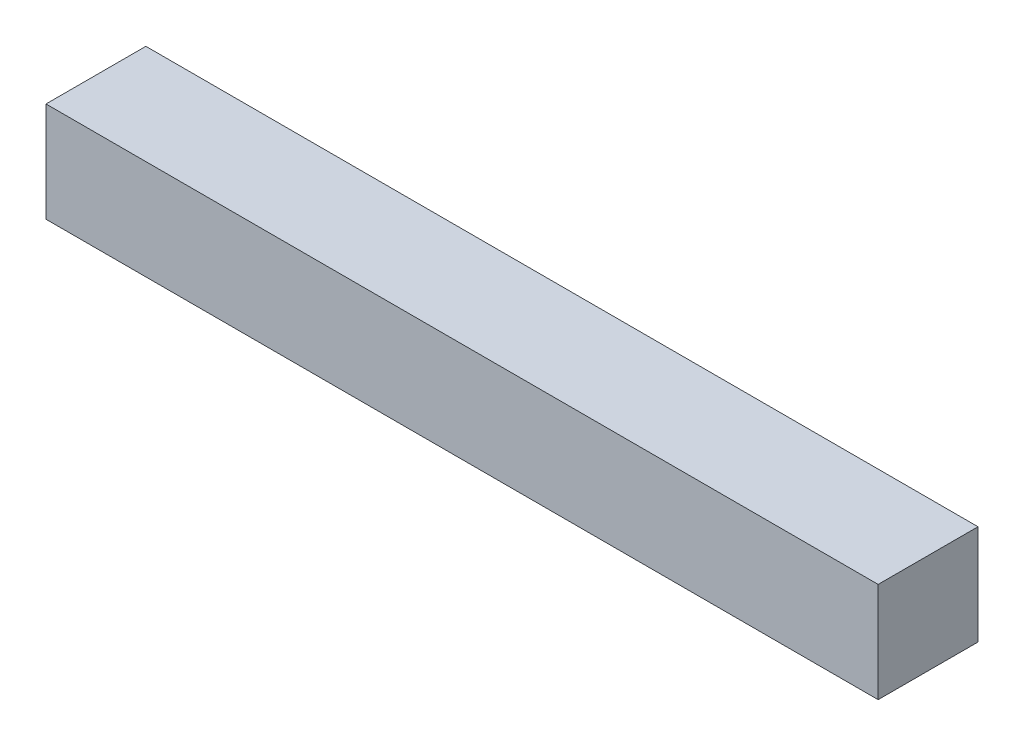
ISO-10303-21;
HEADER;
FILE_DESCRIPTION(('STEP AP214'),'2;1');
FILE_NAME('part.step','',(''),(''),'','','');
FILE_SCHEMA(('AUTOMOTIVE_DESIGN { 1 0 10303 214 1 1 1 1 }'));
ENDSEC;
DATA;
#1=APPLICATION_CONTEXT('core data for automotive mechanical design processes');
#2=APPLICATION_PROTOCOL_DEFINITION('international standard','automotive_design',2000,#1);
#3=PRODUCT_CONTEXT('',#1,'mechanical');
#4=PRODUCT('Part','Part','',(#3));
#5=PRODUCT_RELATED_PRODUCT_CATEGORY('part','',(#4));
#6=PRODUCT_DEFINITION_FORMATION('','',#4);
#7=PRODUCT_DEFINITION_CONTEXT('part definition',#1,'design');
#8=PRODUCT_DEFINITION('design','',#6,#7);
#9=PRODUCT_DEFINITION_SHAPE('','',#8);
#10=(LENGTH_UNIT() NAMED_UNIT(*) SI_UNIT(.MILLI.,.METRE.));
#11=(NAMED_UNIT(*) PLANE_ANGLE_UNIT() SI_UNIT($,.RADIAN.));
#12=(NAMED_UNIT(*) SI_UNIT($,.STERADIAN.) SOLID_ANGLE_UNIT());
#13=UNCERTAINTY_MEASURE_WITH_UNIT(LENGTH_MEASURE(1.E-05),#10,'distance_accuracy_value','');
#14=(GEOMETRIC_REPRESENTATION_CONTEXT(3) GLOBAL_UNCERTAINTY_ASSIGNED_CONTEXT((#13)) GLOBAL_UNIT_ASSIGNED_CONTEXT((#10,
#11,#12)) REPRESENTATION_CONTEXT('',''));
#15=CARTESIAN_POINT('',(0.,0.,0.));
#16=DIRECTION('',(0.,0.,1.));
#17=DIRECTION('',(1.,0.,0.));
#18=AXIS2_PLACEMENT_3D('',#15,#16,#17);
#19=CARTESIAN_POINT('',(250.,30.,60.));
#20=DIRECTION('',(-1.,0.,0.));
#21=DIRECTION('',(0.,0.,1.));
#22=AXIS2_PLACEMENT_3D('',#19,#20,#21);
#23=PLANE('',#22);
#24=DIRECTION('',(0.,1.,0.));
#25=VECTOR('',#24,1.);
#26=CARTESIAN_POINT('',(250.,30.,0.));
#27=LINE('',#26,#25);
#28=CARTESIAN_POINT('',(250.,-30.,0.));
#29=VERTEX_POINT('',#28);
#30=CARTESIAN_POINT('',(250.,30.,0.));
#31=VERTEX_POINT('',#30);
#32=EDGE_CURVE('E97',#29,#31,#27,.T.);
#33=ORIENTED_EDGE('',*,*,#32,.T.);
#34=DIRECTION('',(0.,0.,-1.));
#35=VECTOR('',#34,1.);
#36=CARTESIAN_POINT('',(250.,30.,60.));
#37=LINE('',#36,#35);
#38=CARTESIAN_POINT('',(250.,30.,60.));
#39=VERTEX_POINT('',#38);
#40=EDGE_CURVE('E11',#39,#31,#37,.T.);
#41=ORIENTED_EDGE('',*,*,#40,.F.);
#42=DIRECTION('',(0.,1.,0.));
#43=VECTOR('',#42,1.);
#44=CARTESIAN_POINT('',(250.,30.,60.));
#45=LINE('',#44,#43);
#46=CARTESIAN_POINT('',(250.,-30.,60.));
#47=VERTEX_POINT('',#46);
#48=EDGE_CURVE('E85',#47,#39,#45,.T.);
#49=ORIENTED_EDGE('',*,*,#48,.F.);
#50=DIRECTION('',(0.,0.,-1.));
#51=VECTOR('',#50,1.);
#52=CARTESIAN_POINT('',(250.,-30.,60.));
#53=LINE('',#52,#51);
#54=EDGE_CURVE('E93',#47,#29,#53,.T.);
#55=ORIENTED_EDGE('',*,*,#54,.T.);
#56=EDGE_LOOP('',(#33,#41,#49,#55));
#57=FACE_BOUND('',#56,.T.);
#58=ADVANCED_FACE('F33',(#57),#23,.F.);
#59=CARTESIAN_POINT('',(-250.,30.,60.));
#60=DIRECTION('',(0.,-1.,0.));
#61=DIRECTION('',(0.,0.,-1.));
#62=AXIS2_PLACEMENT_3D('',#59,#60,#61);
#63=PLANE('',#62);
#64=DIRECTION('',(-1.,0.,0.));
#65=VECTOR('',#64,1.);
#66=CARTESIAN_POINT('',(-250.,30.,0.));
#67=LINE('',#66,#65);
#68=CARTESIAN_POINT('',(-250.,30.,0.));
#69=VERTEX_POINT('',#68);
#70=EDGE_CURVE('E89',#31,#69,#67,.T.);
#71=ORIENTED_EDGE('',*,*,#70,.T.);
#72=DIRECTION('',(0.,0.,-1.));
#73=VECTOR('',#72,1.);
#74=CARTESIAN_POINT('',(-250.,30.,60.));
#75=LINE('',#74,#73);
#76=CARTESIAN_POINT('',(-250.,30.,60.));
#77=VERTEX_POINT('',#76);
#78=EDGE_CURVE('E42',#77,#69,#75,.T.);
#79=ORIENTED_EDGE('',*,*,#78,.F.);
#80=DIRECTION('',(-1.,0.,0.));
#81=VECTOR('',#80,1.);
#82=CARTESIAN_POINT('',(-250.,30.,60.));
#83=LINE('',#82,#81);
#84=EDGE_CURVE('E80',#39,#77,#83,.T.);
#85=ORIENTED_EDGE('',*,*,#84,.F.);
#86=ORIENTED_EDGE('',*,*,#40,.T.);
#87=EDGE_LOOP('',(#71,#79,#85,#86));
#88=FACE_BOUND('',#87,.T.);
#89=ADVANCED_FACE('F88',(#88),#63,.F.);
#90=CARTESIAN_POINT('',(-250.,30.,60.));
#91=DIRECTION('',(1.,0.,0.));
#92=DIRECTION('',(0.,0.,-1.));
#93=AXIS2_PLACEMENT_3D('',#90,#91,#92);
#94=PLANE('',#93);
#95=DIRECTION('',(0.,-1.,0.));
#96=VECTOR('',#95,1.);
#97=CARTESIAN_POINT('',(-250.,30.,0.));
#98=LINE('',#97,#96);
#99=CARTESIAN_POINT('',(-250.,-30.,0.));
#100=VERTEX_POINT('',#99);
#101=EDGE_CURVE('E67',#69,#100,#98,.T.);
#102=ORIENTED_EDGE('',*,*,#101,.T.);
#103=DIRECTION('',(0.,0.,-1.));
#104=VECTOR('',#103,1.);
#105=CARTESIAN_POINT('',(-250.,-30.,60.));
#106=LINE('',#105,#104);
#107=CARTESIAN_POINT('',(-250.,-30.,60.));
#108=VERTEX_POINT('',#107);
#109=EDGE_CURVE('E90',#108,#100,#106,.T.);
#110=ORIENTED_EDGE('',*,*,#109,.F.);
#111=DIRECTION('',(0.,-1.,0.));
#112=VECTOR('',#111,1.);
#113=CARTESIAN_POINT('',(-250.,30.,60.));
#114=LINE('',#113,#112);
#115=EDGE_CURVE('E83',#77,#108,#114,.T.);
#116=ORIENTED_EDGE('',*,*,#115,.F.);
#117=ORIENTED_EDGE('',*,*,#78,.T.);
#118=EDGE_LOOP('',(#102,#110,#116,#117));
#119=FACE_BOUND('',#118,.T.);
#120=ADVANCED_FACE('F91',(#119),#94,.F.);
#121=CARTESIAN_POINT('',(-250.,-30.,60.));
#122=DIRECTION('',(0.,1.,0.));
#123=DIRECTION('',(0.,0.,1.));
#124=AXIS2_PLACEMENT_3D('',#121,#122,#123);
#125=PLANE('',#124);
#126=DIRECTION('',(1.,0.,0.));
#127=VECTOR('',#126,1.);
#128=CARTESIAN_POINT('',(-250.,-30.,0.));
#129=LINE('',#128,#127);
#130=EDGE_CURVE('E73',#100,#29,#129,.T.);
#131=ORIENTED_EDGE('',*,*,#130,.T.);
#132=ORIENTED_EDGE('',*,*,#54,.F.);
#133=DIRECTION('',(1.,0.,0.));
#134=VECTOR('',#133,1.);
#135=CARTESIAN_POINT('',(-250.,-30.,60.));
#136=LINE('',#135,#134);
#137=EDGE_CURVE('E50',#108,#47,#136,.T.);
#138=ORIENTED_EDGE('',*,*,#137,.F.);
#139=ORIENTED_EDGE('',*,*,#109,.T.);
#140=EDGE_LOOP('',(#131,#132,#138,#139));
#141=FACE_BOUND('',#140,.T.);
#142=ADVANCED_FACE('F105',(#141),#125,.F.);
#143=CARTESIAN_POINT('',(0.,0.,60.));
#144=DIRECTION('',(0.,0.,1.));
#145=DIRECTION('',(1.,0.,0.));
#146=AXIS2_PLACEMENT_3D('',#143,#144,#145);
#147=PLANE('',#146);
#148=ORIENTED_EDGE('',*,*,#48,.T.);
#149=ORIENTED_EDGE('',*,*,#84,.T.);
#150=ORIENTED_EDGE('',*,*,#115,.T.);
#151=ORIENTED_EDGE('',*,*,#137,.T.);
#152=EDGE_LOOP('',(#148,#149,#150,#151));
#153=FACE_BOUND('',#152,.T.);
#154=ADVANCED_FACE('F81',(#153),#147,.T.);
#155=CARTESIAN_POINT('',(0.,0.,0.));
#156=DIRECTION('',(0.,0.,1.));
#157=DIRECTION('',(1.,0.,0.));
#158=AXIS2_PLACEMENT_3D('',#155,#156,#157);
#159=PLANE('',#158);
#160=CARTESIAN_POINT('',(-187.5,0.,0.));
#161=DIRECTION('',(0.,0.,-1.));
#162=DIRECTION('',(-1.,0.,0.));
#163=AXIS2_PLACEMENT_3D('',#160,#161,#162);
#164=CIRCLE('',#163,25.);
#165=CARTESIAN_POINT('',(-212.5,0.,0.));
#166=VERTEX_POINT('',#165);
#167=EDGE_CURVE('E128',#166,#166,#164,.T.);
#168=ORIENTED_EDGE('',*,*,#167,.F.);
#169=EDGE_LOOP('',(#168));
#170=FACE_BOUND('',#169,.T.);
#171=CARTESIAN_POINT('',(-125.,0.,0.));
#172=DIRECTION('',(0.,0.,-1.));
#173=DIRECTION('',(-1.,0.,0.));
#174=AXIS2_PLACEMENT_3D('',#171,#172,#173);
#175=CIRCLE('',#174,25.);
#176=CARTESIAN_POINT('',(-150.,0.,0.));
#177=VERTEX_POINT('',#176);
#178=EDGE_CURVE('E125',#177,#177,#175,.T.);
#179=ORIENTED_EDGE('',*,*,#178,.F.);
#180=EDGE_LOOP('',(#179));
#181=FACE_BOUND('',#180,.T.);
#182=CARTESIAN_POINT('',(-62.5,0.,0.));
#183=DIRECTION('',(0.,0.,-1.));
#184=DIRECTION('',(-1.,0.,0.));
#185=AXIS2_PLACEMENT_3D('',#182,#183,#184);
#186=CIRCLE('',#185,25.);
#187=CARTESIAN_POINT('',(-87.5,0.,0.));
#188=VERTEX_POINT('',#187);
#189=EDGE_CURVE('E122',#188,#188,#186,.T.);
#190=ORIENTED_EDGE('',*,*,#189,.F.);
#191=EDGE_LOOP('',(#190));
#192=FACE_BOUND('',#191,.T.);
#193=CARTESIAN_POINT('',(0.,0.,0.));
#194=DIRECTION('',(0.,0.,-1.));
#195=DIRECTION('',(-1.,0.,0.));
#196=AXIS2_PLACEMENT_3D('',#193,#194,#195);
#197=CIRCLE('',#196,25.);
#198=CARTESIAN_POINT('',(-25.,0.,0.));
#199=VERTEX_POINT('',#198);
#200=EDGE_CURVE('E119',#199,#199,#197,.T.);
#201=ORIENTED_EDGE('',*,*,#200,.F.);
#202=EDGE_LOOP('',(#201));
#203=FACE_BOUND('',#202,.T.);
#204=CARTESIAN_POINT('',(62.5,0.,0.));
#205=DIRECTION('',(0.,0.,-1.));
#206=DIRECTION('',(-1.,0.,0.));
#207=AXIS2_PLACEMENT_3D('',#204,#205,#206);
#208=CIRCLE('',#207,25.);
#209=CARTESIAN_POINT('',(37.5,0.,0.));
#210=VERTEX_POINT('',#209);
#211=EDGE_CURVE('E116',#210,#210,#208,.T.);
#212=ORIENTED_EDGE('',*,*,#211,.F.);
#213=EDGE_LOOP('',(#212));
#214=FACE_BOUND('',#213,.T.);
#215=CARTESIAN_POINT('',(125.,0.,0.));
#216=DIRECTION('',(0.,0.,-1.));
#217=DIRECTION('',(-1.,0.,0.));
#218=AXIS2_PLACEMENT_3D('',#215,#216,#217);
#219=CIRCLE('',#218,25.);
#220=CARTESIAN_POINT('',(100.,0.,0.));
#221=VERTEX_POINT('',#220);
#222=EDGE_CURVE('E113',#221,#221,#219,.T.);
#223=ORIENTED_EDGE('',*,*,#222,.F.);
#224=EDGE_LOOP('',(#223));
#225=FACE_BOUND('',#224,.T.);
#226=CARTESIAN_POINT('',(187.5,0.,0.));
#227=DIRECTION('',(0.,0.,-1.));
#228=DIRECTION('',(-1.,0.,0.));
#229=AXIS2_PLACEMENT_3D('',#226,#227,#228);
#230=CIRCLE('',#229,25.);
#231=CARTESIAN_POINT('',(162.5,0.,0.));
#232=VERTEX_POINT('',#231);
#233=EDGE_CURVE('E100',#232,#232,#230,.T.);
#234=ORIENTED_EDGE('',*,*,#233,.F.);
#235=EDGE_LOOP('',(#234));
#236=FACE_BOUND('',#235,.T.);
#237=ORIENTED_EDGE('',*,*,#32,.F.);
#238=ORIENTED_EDGE('',*,*,#130,.F.);
#239=ORIENTED_EDGE('',*,*,#101,.F.);
#240=ORIENTED_EDGE('',*,*,#70,.F.);
#241=EDGE_LOOP('',(#237,#238,#239,#240));
#242=FACE_BOUND('',#241,.T.);
#243=ADVANCED_FACE('F108',(#170,#181,#192,#203,#214,#225,#236,#242),#159,.F.);
#244=CARTESIAN_POINT('',(187.5,0.,1.00024155624823E-11));
#245=DIRECTION('',(0.,0.,1.));
#246=DIRECTION('',(1.,0.,0.));
#247=AXIS2_PLACEMENT_3D('',#244,#245,#246);
#248=SPHERICAL_SURFACE('',#247,24.99999999999);
#249=ORIENTED_EDGE('',*,*,#233,.T.);
#250=EDGE_LOOP('',(#249));
#251=FACE_BOUND('',#250,.T.);
#252=ADVANCED_FACE('F136',(#251),#248,.F.);
#253=CARTESIAN_POINT('',(-187.5,0.,1.00024155624823E-11));
#254=DIRECTION('',(0.,0.,1.));
#255=DIRECTION('',(1.,0.,0.));
#256=AXIS2_PLACEMENT_3D('',#253,#254,#255);
#257=SPHERICAL_SURFACE('',#256,24.99999999999);
#258=ORIENTED_EDGE('',*,*,#167,.T.);
#259=EDGE_LOOP('',(#258));
#260=FACE_BOUND('',#259,.T.);
#261=ADVANCED_FACE('F132',(#260),#257,.F.);
#262=CARTESIAN_POINT('',(-125.,0.,1.00024155624823E-11));
#263=DIRECTION('',(0.,0.,1.));
#264=DIRECTION('',(1.,0.,0.));
#265=AXIS2_PLACEMENT_3D('',#262,#263,#264);
#266=SPHERICAL_SURFACE('',#265,24.99999999999);
#267=ORIENTED_EDGE('',*,*,#178,.T.);
#268=EDGE_LOOP('',(#267));
#269=FACE_BOUND('',#268,.T.);
#270=ADVANCED_FACE('F155',(#269),#266,.F.);
#271=CARTESIAN_POINT('',(-62.5,0.,1.00024155624823E-11));
#272=DIRECTION('',(0.,0.,1.));
#273=DIRECTION('',(1.,0.,0.));
#274=AXIS2_PLACEMENT_3D('',#271,#272,#273);
#275=SPHERICAL_SURFACE('',#274,24.99999999999);
#276=ORIENTED_EDGE('',*,*,#189,.T.);
#277=EDGE_LOOP('',(#276));
#278=FACE_BOUND('',#277,.T.);
#279=ADVANCED_FACE('F196',(#278),#275,.F.);
#280=CARTESIAN_POINT('',(0.,0.,1.00024155624823E-11));
#281=DIRECTION('',(0.,0.,1.));
#282=DIRECTION('',(1.,0.,0.));
#283=AXIS2_PLACEMENT_3D('',#280,#281,#282);
#284=SPHERICAL_SURFACE('',#283,24.99999999999);
#285=ORIENTED_EDGE('',*,*,#200,.T.);
#286=EDGE_LOOP('',(#285));
#287=FACE_BOUND('',#286,.T.);
#288=ADVANCED_FACE('F206',(#287),#284,.F.);
#289=CARTESIAN_POINT('',(62.5,0.,1.00024155624823E-11));
#290=DIRECTION('',(0.,0.,1.));
#291=DIRECTION('',(1.,0.,0.));
#292=AXIS2_PLACEMENT_3D('',#289,#290,#291);
#293=SPHERICAL_SURFACE('',#292,24.99999999999);
#294=ORIENTED_EDGE('',*,*,#211,.T.);
#295=EDGE_LOOP('',(#294));
#296=FACE_BOUND('',#295,.T.);
#297=ADVANCED_FACE('F216',(#296),#293,.F.);
#298=CARTESIAN_POINT('',(125.,0.,1.00024155624823E-11));
#299=DIRECTION('',(0.,0.,1.));
#300=DIRECTION('',(1.,0.,0.));
#301=AXIS2_PLACEMENT_3D('',#298,#299,#300);
#302=SPHERICAL_SURFACE('',#301,24.99999999999);
#303=ORIENTED_EDGE('',*,*,#222,.T.);
#304=EDGE_LOOP('',(#303));
#305=FACE_BOUND('',#304,.T.);
#306=ADVANCED_FACE('F35',(#305),#302,.F.);
#307=CLOSED_SHELL('',(#58,#89,#120,#142,#154,#243,#252,#261,#270,#279,#288,#297,#306));
#308=MANIFOLD_SOLID_BREP('B2',#307);
#309=ADVANCED_BREP_SHAPE_REPRESENTATION('',(#18,#308),#14);
#310=SHAPE_DEFINITION_REPRESENTATION(#9,#309);
ENDSEC;
END-ISO-10303-21;
